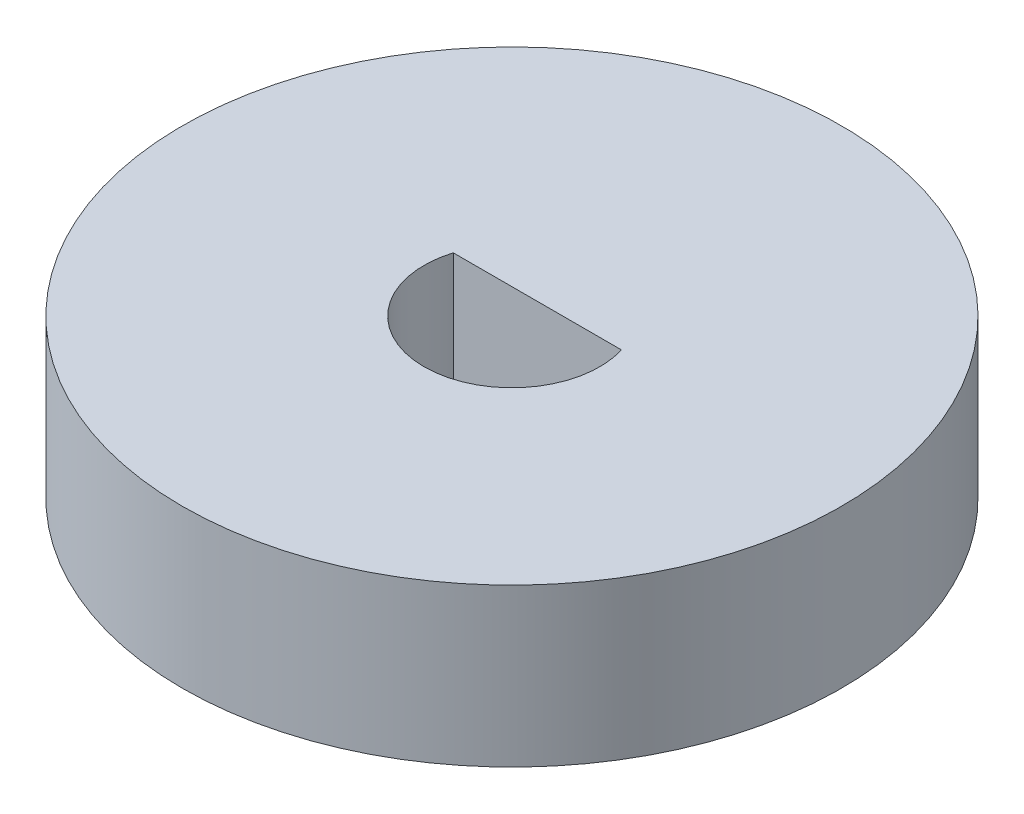
ISO-10303-21;
HEADER;
FILE_DESCRIPTION(('STEP AP214'),'2;1');
FILE_NAME('part.step','',(''),(''),'','','');
FILE_SCHEMA(('AUTOMOTIVE_DESIGN { 1 0 10303 214 1 1 1 1 }'));
ENDSEC;
DATA;
#1=APPLICATION_CONTEXT('core data for automotive mechanical design processes');
#2=APPLICATION_PROTOCOL_DEFINITION('international standard','automotive_design',2000,#1);
#3=PRODUCT_CONTEXT('',#1,'mechanical');
#4=PRODUCT('Part','Part','',(#3));
#5=PRODUCT_RELATED_PRODUCT_CATEGORY('part','',(#4));
#6=PRODUCT_DEFINITION_FORMATION('','',#4);
#7=PRODUCT_DEFINITION_CONTEXT('part definition',#1,'design');
#8=PRODUCT_DEFINITION('design','',#6,#7);
#9=PRODUCT_DEFINITION_SHAPE('','',#8);
#10=(LENGTH_UNIT() NAMED_UNIT(*) SI_UNIT(.MILLI.,.METRE.));
#11=(NAMED_UNIT(*) PLANE_ANGLE_UNIT() SI_UNIT($,.RADIAN.));
#12=(NAMED_UNIT(*) SI_UNIT($,.STERADIAN.) SOLID_ANGLE_UNIT());
#13=UNCERTAINTY_MEASURE_WITH_UNIT(LENGTH_MEASURE(1.E-05),#10,'distance_accuracy_value','');
#14=(GEOMETRIC_REPRESENTATION_CONTEXT(3) GLOBAL_UNCERTAINTY_ASSIGNED_CONTEXT((#13)) GLOBAL_UNIT_ASSIGNED_CONTEXT((#10,
#11,#12)) REPRESENTATION_CONTEXT('',''));
#15=CARTESIAN_POINT('',(0.,0.,0.));
#16=DIRECTION('',(0.,0.,1.));
#17=DIRECTION('',(1.,0.,0.));
#18=AXIS2_PLACEMENT_3D('',#15,#16,#17);
#19=CARTESIAN_POINT('',(0.,5.38,0.));
#20=DIRECTION('',(0.,-1.,0.));
#21=DIRECTION('',(0.,0.,-1.));
#22=AXIS2_PLACEMENT_3D('',#19,#20,#21);
#23=CYLINDRICAL_SURFACE('',#22,11.25);
#24=CARTESIAN_POINT('',(0.,5.38,0.));
#25=DIRECTION('',(0.,1.,0.));
#26=DIRECTION('',(0.,0.,1.));
#27=AXIS2_PLACEMENT_3D('',#24,#25,#26);
#28=CIRCLE('',#27,11.25);
#29=CARTESIAN_POINT('',(0.,5.38,11.25));
#30=VERTEX_POINT('',#29);
#31=EDGE_CURVE('E41',#30,#30,#28,.T.);
#32=ORIENTED_EDGE('',*,*,#31,.F.);
#33=EDGE_LOOP('',(#32));
#34=FACE_BOUND('',#33,.T.);
#35=CARTESIAN_POINT('',(0.,0.,0.));
#36=DIRECTION('',(0.,1.,0.));
#37=DIRECTION('',(0.,0.,1.));
#38=AXIS2_PLACEMENT_3D('',#35,#36,#37);
#39=CIRCLE('',#38,11.25);
#40=CARTESIAN_POINT('',(0.,0.,11.25));
#41=VERTEX_POINT('',#40);
#42=EDGE_CURVE('E69',#41,#41,#39,.T.);
#43=ORIENTED_EDGE('',*,*,#42,.T.);
#44=EDGE_LOOP('',(#43));
#45=FACE_BOUND('',#44,.T.);
#46=ADVANCED_FACE('F34',(#34,#45),#23,.T.);
#47=CARTESIAN_POINT('',(0.,5.38,0.));
#48=DIRECTION('',(0.,1.,0.));
#49=DIRECTION('',(0.,0.,1.));
#50=AXIS2_PLACEMENT_3D('',#47,#48,#49);
#51=PLANE('',#50);
#52=DIRECTION('',(1.,0.,0.));
#53=VECTOR('',#52,1.);
#54=CARTESIAN_POINT('',(-3.,5.38,-0.868539378388265));
#55=LINE('',#54,#53);
#56=CARTESIAN_POINT('',(-2.87152213088963,5.38,-0.868539378388265));
#57=VERTEX_POINT('',#56);
#58=CARTESIAN_POINT('',(2.87152213088963,5.38,-0.868539378388266));
#59=VERTEX_POINT('',#58);
#60=EDGE_CURVE('E72',#57,#59,#55,.T.);
#61=ORIENTED_EDGE('',*,*,#60,.T.);
#62=CARTESIAN_POINT('',(0.,5.38,0.));
#63=DIRECTION('',(0.,1.,0.));
#64=DIRECTION('',(0.,0.,1.));
#65=AXIS2_PLACEMENT_3D('',#62,#63,#64);
#66=CIRCLE('',#65,3.);
#67=EDGE_CURVE('E50',#57,#59,#66,.T.);
#68=ORIENTED_EDGE('',*,*,#67,.F.);
#69=EDGE_LOOP('',(#61,#68));
#70=FACE_BOUND('',#69,.T.);
#71=ORIENTED_EDGE('',*,*,#31,.T.);
#72=EDGE_LOOP('',(#71));
#73=FACE_BOUND('',#72,.T.);
#74=ADVANCED_FACE('F82',(#70,#73),#51,.T.);
#75=CARTESIAN_POINT('',(0.,0.,0.));
#76=DIRECTION('',(0.,1.,0.));
#77=DIRECTION('',(0.,0.,1.));
#78=AXIS2_PLACEMENT_3D('',#75,#76,#77);
#79=PLANE('',#78);
#80=CARTESIAN_POINT('',(0.,0.,0.));
#81=DIRECTION('',(0.,1.,0.));
#82=DIRECTION('',(0.,0.,1.));
#83=AXIS2_PLACEMENT_3D('',#80,#81,#82);
#84=CIRCLE('',#83,3.);
#85=CARTESIAN_POINT('',(-2.87152213088963,0.,-0.868539378388265));
#86=VERTEX_POINT('',#85);
#87=CARTESIAN_POINT('',(2.87152213088963,0.,-0.868539378388265));
#88=VERTEX_POINT('',#87);
#89=EDGE_CURVE('E59',#86,#88,#84,.T.);
#90=ORIENTED_EDGE('',*,*,#89,.T.);
#91=DIRECTION('',(1.,0.,0.));
#92=VECTOR('',#91,1.);
#93=CARTESIAN_POINT('',(-3.,0.,-0.868539378388265));
#94=LINE('',#93,#92);
#95=EDGE_CURVE('E63',#86,#88,#94,.T.);
#96=ORIENTED_EDGE('',*,*,#95,.F.);
#97=EDGE_LOOP('',(#90,#96));
#98=FACE_BOUND('',#97,.T.);
#99=ORIENTED_EDGE('',*,*,#42,.F.);
#100=EDGE_LOOP('',(#99));
#101=FACE_BOUND('',#100,.T.);
#102=ADVANCED_FACE('F67',(#98,#101),#79,.F.);
#103=CARTESIAN_POINT('',(0.,0.,0.));
#104=DIRECTION('',(0.,1.,0.));
#105=DIRECTION('',(0.,0.,1.));
#106=AXIS2_PLACEMENT_3D('',#103,#104,#105);
#107=CYLINDRICAL_SURFACE('',#106,3.);
#108=ORIENTED_EDGE('',*,*,#67,.T.);
#109=DIRECTION('',(0.,1.,0.));
#110=VECTOR('',#109,1.);
#111=CARTESIAN_POINT('',(2.87152213088963,0.,-0.868539378388265));
#112=LINE('',#111,#110);
#113=EDGE_CURVE('E56',#88,#59,#112,.T.);
#114=ORIENTED_EDGE('',*,*,#113,.F.);
#115=ORIENTED_EDGE('',*,*,#89,.F.);
#116=DIRECTION('',(0.,1.,0.));
#117=VECTOR('',#116,1.);
#118=CARTESIAN_POINT('',(-2.87152213088963,0.,-0.868539378388265));
#119=LINE('',#118,#117);
#120=EDGE_CURVE('E11',#86,#57,#119,.T.);
#121=ORIENTED_EDGE('',*,*,#120,.T.);
#122=EDGE_LOOP('',(#108,#114,#115,#121));
#123=FACE_BOUND('',#122,.T.);
#124=ADVANCED_FACE('F58',(#123),#107,.F.);
#125=CARTESIAN_POINT('',(-3.,0.,-0.868539378388265));
#126=DIRECTION('',(0.,0.,1.));
#127=DIRECTION('',(1.,0.,0.));
#128=AXIS2_PLACEMENT_3D('',#125,#126,#127);
#129=PLANE('',#128);
#130=ORIENTED_EDGE('',*,*,#120,.F.);
#131=ORIENTED_EDGE('',*,*,#95,.T.);
#132=ORIENTED_EDGE('',*,*,#113,.T.);
#133=ORIENTED_EDGE('',*,*,#60,.F.);
#134=EDGE_LOOP('',(#130,#131,#132,#133));
#135=FACE_BOUND('',#134,.T.);
#136=ADVANCED_FACE('F71',(#135),#129,.T.);
#137=CLOSED_SHELL('',(#46,#74,#102,#124,#136));
#138=MANIFOLD_SOLID_BREP('B2',#137);
#139=ADVANCED_BREP_SHAPE_REPRESENTATION('',(#18,#138),#14);
#140=SHAPE_DEFINITION_REPRESENTATION(#9,#139);
ENDSEC;
END-ISO-10303-21;
